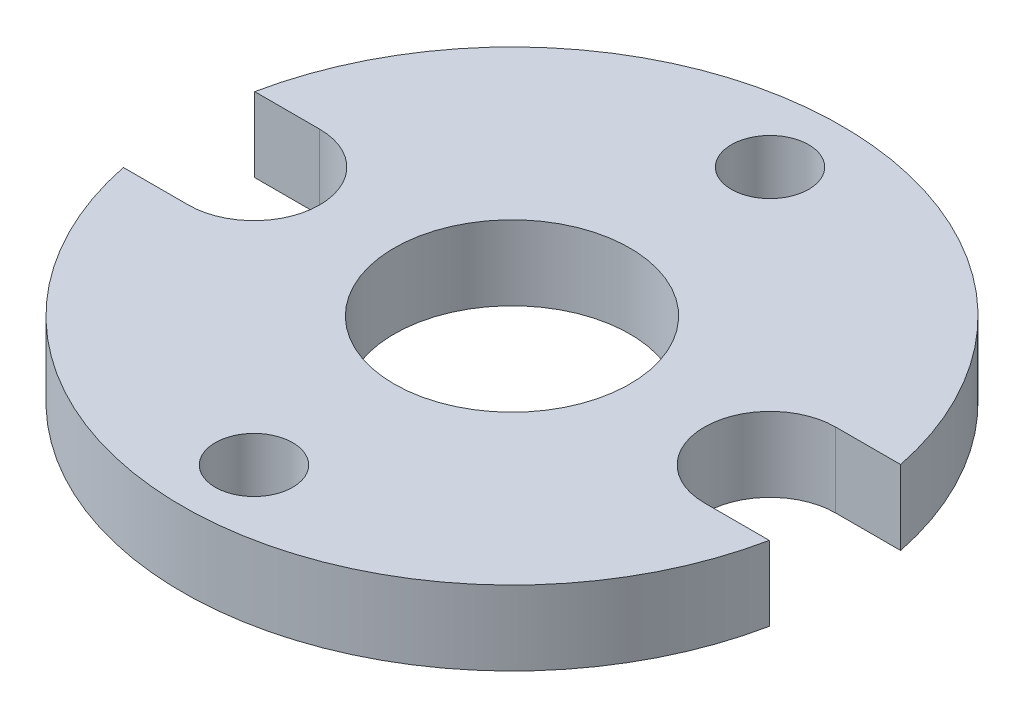
ISO-10303-21;
HEADER;
FILE_DESCRIPTION(('STEP AP214'),'2;1');
FILE_NAME('part.step','',(''),(''),'','','');
FILE_SCHEMA(('AUTOMOTIVE_DESIGN { 1 0 10303 214 1 1 1 1 }'));
ENDSEC;
DATA;
#1=APPLICATION_CONTEXT('core data for automotive mechanical design processes');
#2=APPLICATION_PROTOCOL_DEFINITION('international standard','automotive_design',2000,#1);
#3=PRODUCT_CONTEXT('',#1,'mechanical');
#4=PRODUCT('Part','Part','',(#3));
#5=PRODUCT_RELATED_PRODUCT_CATEGORY('part','',(#4));
#6=PRODUCT_DEFINITION_FORMATION('','',#4);
#7=PRODUCT_DEFINITION_CONTEXT('part definition',#1,'design');
#8=PRODUCT_DEFINITION('design','',#6,#7);
#9=PRODUCT_DEFINITION_SHAPE('','',#8);
#10=(LENGTH_UNIT() NAMED_UNIT(*) SI_UNIT(.MILLI.,.METRE.));
#11=(NAMED_UNIT(*) PLANE_ANGLE_UNIT() SI_UNIT($,.RADIAN.));
#12=(NAMED_UNIT(*) SI_UNIT($,.STERADIAN.) SOLID_ANGLE_UNIT());
#13=UNCERTAINTY_MEASURE_WITH_UNIT(LENGTH_MEASURE(1.E-05),#10,'distance_accuracy_value','');
#14=(GEOMETRIC_REPRESENTATION_CONTEXT(3) GLOBAL_UNCERTAINTY_ASSIGNED_CONTEXT((#13)) GLOBAL_UNIT_ASSIGNED_CONTEXT((#10,
#11,#12)) REPRESENTATION_CONTEXT('',''));
#15=CARTESIAN_POINT('',(0.,0.,0.));
#16=DIRECTION('',(0.,0.,1.));
#17=DIRECTION('',(1.,0.,0.));
#18=AXIS2_PLACEMENT_3D('',#15,#16,#17);
#19=CARTESIAN_POINT('',(-11.,3.175,0.));
#20=DIRECTION('',(0.,1.,0.));
#21=DIRECTION('',(0.,0.,1.));
#22=AXIS2_PLACEMENT_3D('',#19,#20,#21);
#23=PLANE('',#22);
#24=CARTESIAN_POINT('',(0.,3.175,-11.));
#25=DIRECTION('',(0.,1.,0.));
#26=DIRECTION('',(0.,0.,1.));
#27=AXIS2_PLACEMENT_3D('',#24,#25,#26);
#28=CIRCLE('',#27,1.65);
#29=CARTESIAN_POINT('',(0.,3.175,-9.35));
#30=VERTEX_POINT('',#29);
#31=EDGE_CURVE('E219',#30,#30,#28,.T.);
#32=ORIENTED_EDGE('',*,*,#31,.F.);
#33=EDGE_LOOP('',(#32));
#34=FACE_BOUND('',#33,.T.);
#35=CARTESIAN_POINT('',(-11.,3.175,0.));
#36=DIRECTION('',(0.,-1.,0.));
#37=DIRECTION('',(0.,0.,1.));
#38=AXIS2_PLACEMENT_3D('',#35,#36,#37);
#39=CIRCLE('',#38,2.8);
#40=CARTESIAN_POINT('',(-11.,3.175,-2.8));
#41=VERTEX_POINT('',#40);
#42=CARTESIAN_POINT('',(-11.,3.175,2.8));
#43=VERTEX_POINT('',#42);
#44=EDGE_CURVE('E170',#41,#43,#39,.T.);
#45=ORIENTED_EDGE('',*,*,#44,.T.);
#46=DIRECTION('',(-1.,0.,0.));
#47=VECTOR('',#46,1.);
#48=CARTESIAN_POINT('',(-11.,3.175,2.8));
#49=LINE('',#48,#47);
#50=CARTESIAN_POINT('',(-13.7681698130144,3.175,2.8));
#51=VERTEX_POINT('',#50);
#52=EDGE_CURVE('E106',#43,#51,#49,.T.);
#53=ORIENTED_EDGE('',*,*,#52,.T.);
#54=CARTESIAN_POINT('',(0.,3.175,0.));
#55=DIRECTION('',(0.,1.,0.));
#56=DIRECTION('',(0.,0.,1.));
#57=AXIS2_PLACEMENT_3D('',#54,#55,#56);
#58=CIRCLE('',#57,14.05);
#59=CARTESIAN_POINT('',(13.7681698130144,3.175,2.8));
#60=VERTEX_POINT('',#59);
#61=EDGE_CURVE('E191',#51,#60,#58,.T.);
#62=ORIENTED_EDGE('',*,*,#61,.T.);
#63=DIRECTION('',(-1.,0.,0.));
#64=VECTOR('',#63,1.);
#65=CARTESIAN_POINT('',(11.,3.175,2.8));
#66=LINE('',#65,#64);
#67=CARTESIAN_POINT('',(11.,3.175,2.8));
#68=VERTEX_POINT('',#67);
#69=EDGE_CURVE('E205',#60,#68,#66,.T.);
#70=ORIENTED_EDGE('',*,*,#69,.T.);
#71=CARTESIAN_POINT('',(11.,3.175,0.));
#72=DIRECTION('',(0.,-1.,0.));
#73=DIRECTION('',(0.,0.,1.));
#74=AXIS2_PLACEMENT_3D('',#71,#72,#73);
#75=CIRCLE('',#74,2.8);
#76=CARTESIAN_POINT('',(11.,3.175,-2.80000000000001));
#77=VERTEX_POINT('',#76);
#78=EDGE_CURVE('E125',#68,#77,#75,.T.);
#79=ORIENTED_EDGE('',*,*,#78,.T.);
#80=DIRECTION('',(1.,0.,0.));
#81=VECTOR('',#80,1.);
#82=CARTESIAN_POINT('',(13.7681698130144,3.175,-2.8));
#83=LINE('',#82,#81);
#84=CARTESIAN_POINT('',(13.7681698130144,3.175,-2.8));
#85=VERTEX_POINT('',#84);
#86=EDGE_CURVE('E119',#77,#85,#83,.T.);
#87=ORIENTED_EDGE('',*,*,#86,.T.);
#88=CARTESIAN_POINT('',(0.,3.175,0.));
#89=DIRECTION('',(0.,1.,0.));
#90=DIRECTION('',(0.,0.,1.));
#91=AXIS2_PLACEMENT_3D('',#88,#89,#90);
#92=CIRCLE('',#91,14.05);
#93=CARTESIAN_POINT('',(-13.7681698130144,3.175,-2.8));
#94=VERTEX_POINT('',#93);
#95=EDGE_CURVE('E123',#85,#94,#92,.T.);
#96=ORIENTED_EDGE('',*,*,#95,.T.);
#97=DIRECTION('',(1.,0.,0.));
#98=VECTOR('',#97,1.);
#99=CARTESIAN_POINT('',(-11.,3.175,-2.8));
#100=LINE('',#99,#98);
#101=EDGE_CURVE('E63',#94,#41,#100,.T.);
#102=ORIENTED_EDGE('',*,*,#101,.T.);
#103=EDGE_LOOP('',(#45,#53,#62,#70,#79,#87,#96,#102));
#104=FACE_BOUND('',#103,.T.);
#105=CARTESIAN_POINT('',(0.,3.175,0.));
#106=DIRECTION('',(0.,1.,0.));
#107=DIRECTION('',(0.,0.,1.));
#108=AXIS2_PLACEMENT_3D('',#105,#106,#107);
#109=CIRCLE('',#108,5.025);
#110=CARTESIAN_POINT('',(0.,3.175,5.025));
#111=VERTEX_POINT('',#110);
#112=EDGE_CURVE('E152',#111,#111,#109,.T.);
#113=ORIENTED_EDGE('',*,*,#112,.F.);
#114=EDGE_LOOP('',(#113));
#115=FACE_BOUND('',#114,.T.);
#116=CARTESIAN_POINT('',(0.,3.175,11.));
#117=DIRECTION('',(0.,1.,0.));
#118=DIRECTION('',(0.,0.,1.));
#119=AXIS2_PLACEMENT_3D('',#116,#117,#118);
#120=CIRCLE('',#119,1.65);
#121=CARTESIAN_POINT('',(0.,3.175,12.65));
#122=VERTEX_POINT('',#121);
#123=EDGE_CURVE('E227',#122,#122,#120,.T.);
#124=ORIENTED_EDGE('',*,*,#123,.F.);
#125=EDGE_LOOP('',(#124));
#126=FACE_BOUND('',#125,.T.);
#127=ADVANCED_FACE('F45',(#34,#104,#115,#126),#23,.T.);
#128=CARTESIAN_POINT('',(-11.,0.,0.));
#129=DIRECTION('',(0.,1.,0.));
#130=DIRECTION('',(0.,0.,1.));
#131=AXIS2_PLACEMENT_3D('',#128,#129,#130);
#132=PLANE('',#131);
#133=CARTESIAN_POINT('',(-11.,0.,0.));
#134=DIRECTION('',(0.,-1.,0.));
#135=DIRECTION('',(0.,0.,1.));
#136=AXIS2_PLACEMENT_3D('',#133,#134,#135);
#137=CIRCLE('',#136,2.8);
#138=CARTESIAN_POINT('',(-11.,0.,-2.8));
#139=VERTEX_POINT('',#138);
#140=CARTESIAN_POINT('',(-11.,0.,2.8));
#141=VERTEX_POINT('',#140);
#142=EDGE_CURVE('E147',#139,#141,#137,.T.);
#143=ORIENTED_EDGE('',*,*,#142,.F.);
#144=DIRECTION('',(1.,0.,0.));
#145=VECTOR('',#144,1.);
#146=CARTESIAN_POINT('',(-11.,0.,-2.8));
#147=LINE('',#146,#145);
#148=CARTESIAN_POINT('',(-13.7681698130144,0.,-2.8));
#149=VERTEX_POINT('',#148);
#150=EDGE_CURVE('E98',#149,#139,#147,.T.);
#151=ORIENTED_EDGE('',*,*,#150,.F.);
#152=CARTESIAN_POINT('',(0.,0.,0.));
#153=DIRECTION('',(0.,1.,0.));
#154=DIRECTION('',(0.,0.,1.));
#155=AXIS2_PLACEMENT_3D('',#152,#153,#154);
#156=CIRCLE('',#155,14.05);
#157=CARTESIAN_POINT('',(13.7681698130144,0.,-2.8));
#158=VERTEX_POINT('',#157);
#159=EDGE_CURVE('E92',#158,#149,#156,.T.);
#160=ORIENTED_EDGE('',*,*,#159,.F.);
#161=DIRECTION('',(1.,0.,0.));
#162=VECTOR('',#161,1.);
#163=CARTESIAN_POINT('',(13.7681698130144,0.,-2.8));
#164=LINE('',#163,#162);
#165=CARTESIAN_POINT('',(11.,0.,-2.80000000000001));
#166=VERTEX_POINT('',#165);
#167=EDGE_CURVE('E134',#166,#158,#164,.T.);
#168=ORIENTED_EDGE('',*,*,#167,.F.);
#169=CARTESIAN_POINT('',(11.,0.,0.));
#170=DIRECTION('',(0.,-1.,0.));
#171=DIRECTION('',(0.,0.,1.));
#172=AXIS2_PLACEMENT_3D('',#169,#170,#171);
#173=CIRCLE('',#172,2.8);
#174=CARTESIAN_POINT('',(11.,0.,2.8));
#175=VERTEX_POINT('',#174);
#176=EDGE_CURVE('E161',#175,#166,#173,.T.);
#177=ORIENTED_EDGE('',*,*,#176,.F.);
#178=DIRECTION('',(-1.,0.,0.));
#179=VECTOR('',#178,1.);
#180=CARTESIAN_POINT('',(11.,0.,2.8));
#181=LINE('',#180,#179);
#182=CARTESIAN_POINT('',(13.7681698130144,0.,2.8));
#183=VERTEX_POINT('',#182);
#184=EDGE_CURVE('E158',#183,#175,#181,.T.);
#185=ORIENTED_EDGE('',*,*,#184,.F.);
#186=CARTESIAN_POINT('',(0.,0.,0.));
#187=DIRECTION('',(0.,1.,0.));
#188=DIRECTION('',(0.,0.,1.));
#189=AXIS2_PLACEMENT_3D('',#186,#187,#188);
#190=CIRCLE('',#189,14.05);
#191=CARTESIAN_POINT('',(-13.7681698130144,0.,2.8));
#192=VERTEX_POINT('',#191);
#193=EDGE_CURVE('E155',#192,#183,#190,.T.);
#194=ORIENTED_EDGE('',*,*,#193,.F.);
#195=DIRECTION('',(-1.,0.,0.));
#196=VECTOR('',#195,1.);
#197=CARTESIAN_POINT('',(-11.,0.,2.8));
#198=LINE('',#197,#196);
#199=EDGE_CURVE('E151',#141,#192,#198,.T.);
#200=ORIENTED_EDGE('',*,*,#199,.F.);
#201=EDGE_LOOP('',(#143,#151,#160,#168,#177,#185,#194,#200));
#202=FACE_BOUND('',#201,.T.);
#203=CARTESIAN_POINT('',(0.,0.,0.));
#204=DIRECTION('',(0.,1.,0.));
#205=DIRECTION('',(0.,0.,1.));
#206=AXIS2_PLACEMENT_3D('',#203,#204,#205);
#207=CIRCLE('',#206,5.025);
#208=CARTESIAN_POINT('',(0.,0.,5.025));
#209=VERTEX_POINT('',#208);
#210=EDGE_CURVE('E215',#209,#209,#207,.T.);
#211=ORIENTED_EDGE('',*,*,#210,.T.);
#212=EDGE_LOOP('',(#211));
#213=FACE_BOUND('',#212,.T.);
#214=CARTESIAN_POINT('',(0.,0.,-11.));
#215=DIRECTION('',(0.,1.,0.));
#216=DIRECTION('',(0.,0.,1.));
#217=AXIS2_PLACEMENT_3D('',#214,#215,#216);
#218=CIRCLE('',#217,1.65);
#219=CARTESIAN_POINT('',(0.,0.,-9.35));
#220=VERTEX_POINT('',#219);
#221=EDGE_CURVE('E223',#220,#220,#218,.T.);
#222=ORIENTED_EDGE('',*,*,#221,.T.);
#223=EDGE_LOOP('',(#222));
#224=FACE_BOUND('',#223,.T.);
#225=CARTESIAN_POINT('',(0.,0.,11.));
#226=DIRECTION('',(0.,1.,0.));
#227=DIRECTION('',(0.,0.,1.));
#228=AXIS2_PLACEMENT_3D('',#225,#226,#227);
#229=CIRCLE('',#228,1.65);
#230=CARTESIAN_POINT('',(0.,0.,12.65));
#231=VERTEX_POINT('',#230);
#232=EDGE_CURVE('E231',#231,#231,#229,.T.);
#233=ORIENTED_EDGE('',*,*,#232,.T.);
#234=EDGE_LOOP('',(#233));
#235=FACE_BOUND('',#234,.T.);
#236=ADVANCED_FACE('F195',(#202,#213,#224,#235),#132,.F.);
#237=CARTESIAN_POINT('',(-11.,3.175,0.));
#238=DIRECTION('',(0.,-1.,0.));
#239=DIRECTION('',(0.,0.,-1.));
#240=AXIS2_PLACEMENT_3D('',#237,#238,#239);
#241=CYLINDRICAL_SURFACE('',#240,2.8);
#242=ORIENTED_EDGE('',*,*,#142,.T.);
#243=DIRECTION('',(0.,-1.,0.));
#244=VECTOR('',#243,1.);
#245=CARTESIAN_POINT('',(-11.,3.175,2.8));
#246=LINE('',#245,#244);
#247=EDGE_CURVE('E11',#43,#141,#246,.T.);
#248=ORIENTED_EDGE('',*,*,#247,.F.);
#249=ORIENTED_EDGE('',*,*,#44,.F.);
#250=DIRECTION('',(0.,-1.,0.));
#251=VECTOR('',#250,1.);
#252=CARTESIAN_POINT('',(-11.,3.175,-2.8));
#253=LINE('',#252,#251);
#254=EDGE_CURVE('E143',#41,#139,#253,.T.);
#255=ORIENTED_EDGE('',*,*,#254,.T.);
#256=EDGE_LOOP('',(#242,#248,#249,#255));
#257=FACE_BOUND('',#256,.T.);
#258=ADVANCED_FACE('F47',(#257),#241,.F.);
#259=CARTESIAN_POINT('',(-11.,3.175,2.8));
#260=DIRECTION('',(0.,0.,1.));
#261=DIRECTION('',(1.,0.,0.));
#262=AXIS2_PLACEMENT_3D('',#259,#260,#261);
#263=PLANE('',#262);
#264=ORIENTED_EDGE('',*,*,#199,.T.);
#265=DIRECTION('',(0.,-1.,0.));
#266=VECTOR('',#265,1.);
#267=CARTESIAN_POINT('',(-13.7681698130144,3.175,2.8));
#268=LINE('',#267,#266);
#269=EDGE_CURVE('E55',#51,#192,#268,.T.);
#270=ORIENTED_EDGE('',*,*,#269,.F.);
#271=ORIENTED_EDGE('',*,*,#52,.F.);
#272=ORIENTED_EDGE('',*,*,#247,.T.);
#273=EDGE_LOOP('',(#264,#270,#271,#272));
#274=FACE_BOUND('',#273,.T.);
#275=ADVANCED_FACE('F266',(#274),#263,.F.);
#276=CARTESIAN_POINT('',(0.,3.175,0.));
#277=DIRECTION('',(0.,-1.,0.));
#278=DIRECTION('',(0.,0.,-1.));
#279=AXIS2_PLACEMENT_3D('',#276,#277,#278);
#280=CYLINDRICAL_SURFACE('',#279,14.05);
#281=ORIENTED_EDGE('',*,*,#193,.T.);
#282=DIRECTION('',(0.,-1.,0.));
#283=VECTOR('',#282,1.);
#284=CARTESIAN_POINT('',(13.7681698130144,3.175,2.8));
#285=LINE('',#284,#283);
#286=EDGE_CURVE('E181',#60,#183,#285,.T.);
#287=ORIENTED_EDGE('',*,*,#286,.F.);
#288=ORIENTED_EDGE('',*,*,#61,.F.);
#289=ORIENTED_EDGE('',*,*,#269,.T.);
#290=EDGE_LOOP('',(#281,#287,#288,#289));
#291=FACE_BOUND('',#290,.T.);
#292=ADVANCED_FACE('F189',(#291),#280,.T.);
#293=CARTESIAN_POINT('',(11.,3.175,2.8));
#294=DIRECTION('',(0.,0.,1.));
#295=DIRECTION('',(1.,0.,0.));
#296=AXIS2_PLACEMENT_3D('',#293,#294,#295);
#297=PLANE('',#296);
#298=ORIENTED_EDGE('',*,*,#184,.T.);
#299=DIRECTION('',(0.,-1.,0.));
#300=VECTOR('',#299,1.);
#301=CARTESIAN_POINT('',(11.,3.175,2.8));
#302=LINE('',#301,#300);
#303=EDGE_CURVE('E177',#68,#175,#302,.T.);
#304=ORIENTED_EDGE('',*,*,#303,.F.);
#305=ORIENTED_EDGE('',*,*,#69,.F.);
#306=ORIENTED_EDGE('',*,*,#286,.T.);
#307=EDGE_LOOP('',(#298,#304,#305,#306));
#308=FACE_BOUND('',#307,.T.);
#309=ADVANCED_FACE('F200',(#308),#297,.F.);
#310=CARTESIAN_POINT('',(11.,3.175,0.));
#311=DIRECTION('',(0.,-1.,0.));
#312=DIRECTION('',(0.,0.,-1.));
#313=AXIS2_PLACEMENT_3D('',#310,#311,#312);
#314=CYLINDRICAL_SURFACE('',#313,2.8);
#315=ORIENTED_EDGE('',*,*,#176,.T.);
#316=DIRECTION('',(0.,-1.,0.));
#317=VECTOR('',#316,1.);
#318=CARTESIAN_POINT('',(11.,3.175,-2.80000000000001));
#319=LINE('',#318,#317);
#320=EDGE_CURVE('E136',#77,#166,#319,.T.);
#321=ORIENTED_EDGE('',*,*,#320,.F.);
#322=ORIENTED_EDGE('',*,*,#78,.F.);
#323=ORIENTED_EDGE('',*,*,#303,.T.);
#324=EDGE_LOOP('',(#315,#321,#322,#323));
#325=FACE_BOUND('',#324,.T.);
#326=ADVANCED_FACE('F203',(#325),#314,.F.);
#327=CARTESIAN_POINT('',(13.7681698130144,3.175,-2.8));
#328=DIRECTION('',(0.,0.,-1.));
#329=DIRECTION('',(-1.,0.,0.));
#330=AXIS2_PLACEMENT_3D('',#327,#328,#329);
#331=PLANE('',#330);
#332=ORIENTED_EDGE('',*,*,#167,.T.);
#333=DIRECTION('',(0.,-1.,0.));
#334=VECTOR('',#333,1.);
#335=CARTESIAN_POINT('',(13.7681698130144,3.175,-2.8));
#336=LINE('',#335,#334);
#337=EDGE_CURVE('E131',#85,#158,#336,.T.);
#338=ORIENTED_EDGE('',*,*,#337,.F.);
#339=ORIENTED_EDGE('',*,*,#86,.F.);
#340=ORIENTED_EDGE('',*,*,#320,.T.);
#341=EDGE_LOOP('',(#332,#338,#339,#340));
#342=FACE_BOUND('',#341,.T.);
#343=ADVANCED_FACE('F132',(#342),#331,.F.);
#344=CARTESIAN_POINT('',(0.,3.175,0.));
#345=DIRECTION('',(0.,-1.,0.));
#346=DIRECTION('',(0.,0.,-1.));
#347=AXIS2_PLACEMENT_3D('',#344,#345,#346);
#348=CYLINDRICAL_SURFACE('',#347,14.05);
#349=ORIENTED_EDGE('',*,*,#159,.T.);
#350=DIRECTION('',(0.,-1.,0.));
#351=VECTOR('',#350,1.);
#352=CARTESIAN_POINT('',(-13.7681698130144,3.175,-2.8));
#353=LINE('',#352,#351);
#354=EDGE_CURVE('E137',#94,#149,#353,.T.);
#355=ORIENTED_EDGE('',*,*,#354,.F.);
#356=ORIENTED_EDGE('',*,*,#95,.F.);
#357=ORIENTED_EDGE('',*,*,#337,.T.);
#358=EDGE_LOOP('',(#349,#355,#356,#357));
#359=FACE_BOUND('',#358,.T.);
#360=ADVANCED_FACE('F139',(#359),#348,.T.);
#361=CARTESIAN_POINT('',(-11.,3.175,-2.8));
#362=DIRECTION('',(0.,0.,-1.));
#363=DIRECTION('',(-1.,0.,0.));
#364=AXIS2_PLACEMENT_3D('',#361,#362,#363);
#365=PLANE('',#364);
#366=ORIENTED_EDGE('',*,*,#150,.T.);
#367=ORIENTED_EDGE('',*,*,#254,.F.);
#368=ORIENTED_EDGE('',*,*,#101,.F.);
#369=ORIENTED_EDGE('',*,*,#354,.T.);
#370=EDGE_LOOP('',(#366,#367,#368,#369));
#371=FACE_BOUND('',#370,.T.);
#372=ADVANCED_FACE('F254',(#371),#365,.F.);
#373=CARTESIAN_POINT('',(0.,3.175,0.));
#374=DIRECTION('',(0.,-1.,0.));
#375=DIRECTION('',(0.,0.,-1.));
#376=AXIS2_PLACEMENT_3D('',#373,#374,#375);
#377=CYLINDRICAL_SURFACE('',#376,5.025);
#378=ORIENTED_EDGE('',*,*,#112,.T.);
#379=EDGE_LOOP('',(#378));
#380=FACE_BOUND('',#379,.T.);
#381=ORIENTED_EDGE('',*,*,#210,.F.);
#382=EDGE_LOOP('',(#381));
#383=FACE_BOUND('',#382,.T.);
#384=ADVANCED_FACE('F251',(#380,#383),#377,.F.);
#385=CARTESIAN_POINT('',(0.,3.175,-11.));
#386=DIRECTION('',(0.,-1.,0.));
#387=DIRECTION('',(0.,0.,-1.));
#388=AXIS2_PLACEMENT_3D('',#385,#386,#387);
#389=CYLINDRICAL_SURFACE('',#388,1.65);
#390=ORIENTED_EDGE('',*,*,#31,.T.);
#391=EDGE_LOOP('',(#390));
#392=FACE_BOUND('',#391,.T.);
#393=ORIENTED_EDGE('',*,*,#221,.F.);
#394=EDGE_LOOP('',(#393));
#395=FACE_BOUND('',#394,.T.);
#396=ADVANCED_FACE('F341',(#392,#395),#389,.F.);
#397=CARTESIAN_POINT('',(0.,3.175,11.));
#398=DIRECTION('',(0.,-1.,0.));
#399=DIRECTION('',(0.,0.,-1.));
#400=AXIS2_PLACEMENT_3D('',#397,#398,#399);
#401=CYLINDRICAL_SURFACE('',#400,1.65);
#402=ORIENTED_EDGE('',*,*,#123,.T.);
#403=EDGE_LOOP('',(#402));
#404=FACE_BOUND('',#403,.T.);
#405=ORIENTED_EDGE('',*,*,#232,.F.);
#406=EDGE_LOOP('',(#405));
#407=FACE_BOUND('',#406,.T.);
#408=ADVANCED_FACE('F239',(#404,#407),#401,.F.);
#409=CLOSED_SHELL('',(#127,#236,#258,#275,#292,#309,#326,#343,#360,#372,#384,#396,#408));
#410=MANIFOLD_SOLID_BREP('B2',#409);
#411=ADVANCED_BREP_SHAPE_REPRESENTATION('',(#18,#410),#14);
#412=SHAPE_DEFINITION_REPRESENTATION(#9,#411);
ENDSEC;
END-ISO-10303-21;
